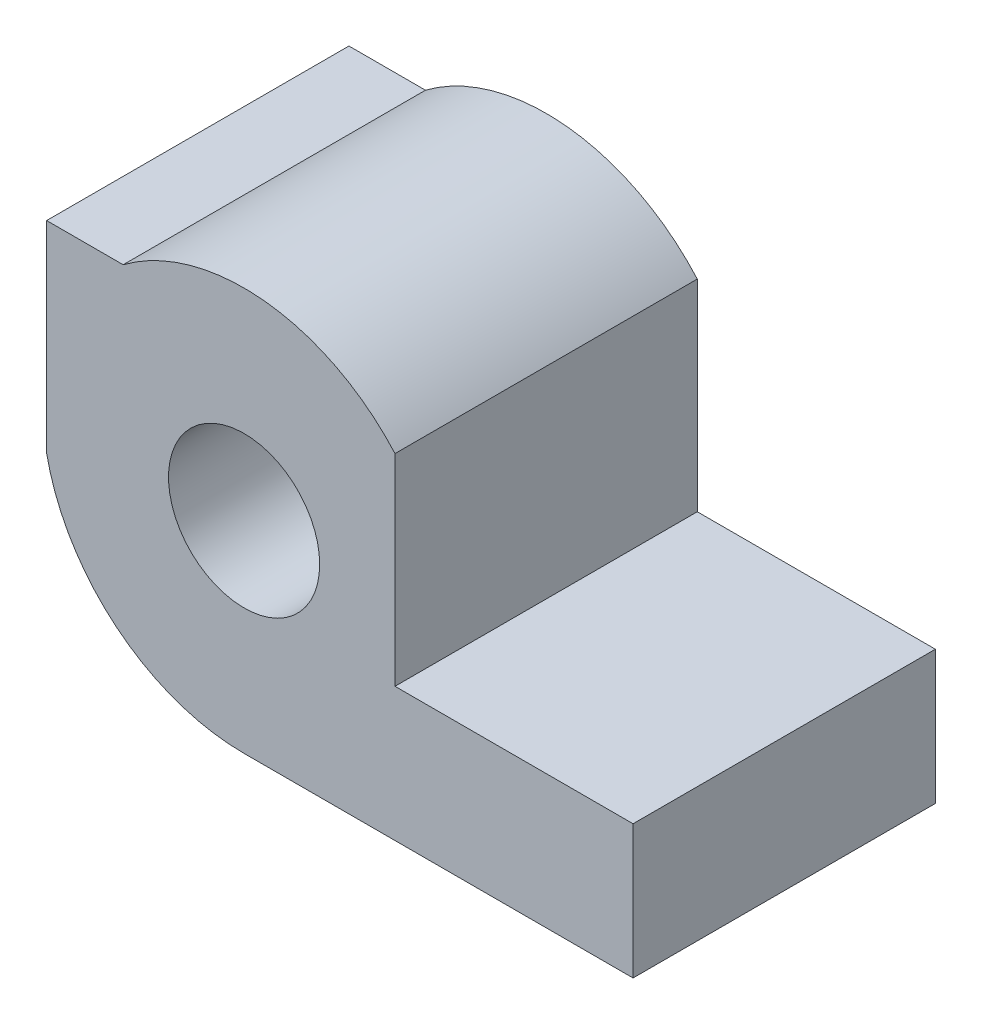
ISO-10303-21;
HEADER;
FILE_DESCRIPTION(('STEP AP214'),'2;1');
FILE_NAME('part.step','',(''),(''),'','','');
FILE_SCHEMA(('AUTOMOTIVE_DESIGN { 1 0 10303 214 1 1 1 1 }'));
ENDSEC;
DATA;
#1=APPLICATION_CONTEXT('core data for automotive mechanical design processes');
#2=APPLICATION_PROTOCOL_DEFINITION('international standard','automotive_design',2000,#1);
#3=PRODUCT_CONTEXT('',#1,'mechanical');
#4=PRODUCT('Part','Part','',(#3));
#5=PRODUCT_RELATED_PRODUCT_CATEGORY('part','',(#4));
#6=PRODUCT_DEFINITION_FORMATION('','',#4);
#7=PRODUCT_DEFINITION_CONTEXT('part definition',#1,'design');
#8=PRODUCT_DEFINITION('design','',#6,#7);
#9=PRODUCT_DEFINITION_SHAPE('','',#8);
#10=(LENGTH_UNIT() NAMED_UNIT(*) SI_UNIT(.MILLI.,.METRE.));
#11=(NAMED_UNIT(*) PLANE_ANGLE_UNIT() SI_UNIT($,.RADIAN.));
#12=(NAMED_UNIT(*) SI_UNIT($,.STERADIAN.) SOLID_ANGLE_UNIT());
#13=UNCERTAINTY_MEASURE_WITH_UNIT(LENGTH_MEASURE(1.E-05),#10,'distance_accuracy_value','');
#14=(GEOMETRIC_REPRESENTATION_CONTEXT(3) GLOBAL_UNCERTAINTY_ASSIGNED_CONTEXT((#13)) GLOBAL_UNIT_ASSIGNED_CONTEXT((#10,
#11,#12)) REPRESENTATION_CONTEXT('',''));
#15=CARTESIAN_POINT('',(0.,0.,0.));
#16=DIRECTION('',(0.,0.,1.));
#17=DIRECTION('',(1.,0.,0.));
#18=AXIS2_PLACEMENT_3D('',#15,#16,#17);
#19=CARTESIAN_POINT('',(0.599591794226535,0.,6.));
#20=DIRECTION('',(0.,0.,1.));
#21=DIRECTION('',(1.,0.,0.));
#22=AXIS2_PLACEMENT_3D('',#19,#20,#21);
#23=PLANE('',#22);
#24=CARTESIAN_POINT('',(0.599591794226535,0.,6.));
#25=DIRECTION('',(0.,0.,1.));
#26=DIRECTION('',(1.,0.,0.));
#27=AXIS2_PLACEMENT_3D('',#24,#25,#26);
#28=CIRCLE('',#27,3.99999999999998);
#29=CARTESIAN_POINT('',(-3.31959179422655,-0.799999999999803,6.));
#30=VERTEX_POINT('',#29);
#31=CARTESIAN_POINT('',(0.599591794226577,-4.,6.));
#32=VERTEX_POINT('',#31);
#33=EDGE_CURVE('E145',#30,#32,#28,.T.);
#34=ORIENTED_EDGE('',*,*,#33,.T.);
#35=DIRECTION('',(1.,0.,0.));
#36=VECTOR('',#35,1.);
#37=CARTESIAN_POINT('',(8.31959179422655,-4.,6.));
#38=LINE('',#37,#36);
#39=CARTESIAN_POINT('',(8.31959179422655,-4.,6.));
#40=VERTEX_POINT('',#39);
#41=EDGE_CURVE('E93',#32,#40,#38,.T.);
#42=ORIENTED_EDGE('',*,*,#41,.T.);
#43=DIRECTION('',(0.,1.,0.));
#44=VECTOR('',#43,1.);
#45=CARTESIAN_POINT('',(8.31959179422655,-1.34852681521835,6.));
#46=LINE('',#45,#44);
#47=CARTESIAN_POINT('',(8.31959179422655,-1.34852681521835,6.));
#48=VERTEX_POINT('',#47);
#49=EDGE_CURVE('E160',#40,#48,#46,.T.);
#50=ORIENTED_EDGE('',*,*,#49,.T.);
#51=DIRECTION('',(-1.,0.,0.));
#52=VECTOR('',#51,1.);
#53=CARTESIAN_POINT('',(3.59453585887705,-1.34852681521835,6.));
#54=LINE('',#53,#52);
#55=CARTESIAN_POINT('',(3.59453585887705,-1.34852681521835,6.));
#56=VERTEX_POINT('',#55);
#57=EDGE_CURVE('E173',#48,#56,#54,.T.);
#58=ORIENTED_EDGE('',*,*,#57,.T.);
#59=DIRECTION('',(0.,1.,0.));
#60=VECTOR('',#59,1.);
#61=CARTESIAN_POINT('',(3.59453585887705,2.65147318478138,6.));
#62=LINE('',#61,#60);
#63=CARTESIAN_POINT('',(3.59453585887705,2.65147318478138,6.));
#64=VERTEX_POINT('',#63);
#65=EDGE_CURVE('E112',#56,#64,#62,.T.);
#66=ORIENTED_EDGE('',*,*,#65,.T.);
#67=CARTESIAN_POINT('',(0.599591794226535,0.,6.));
#68=DIRECTION('',(0.,0.,1.));
#69=DIRECTION('',(1.,0.,0.));
#70=AXIS2_PLACEMENT_3D('',#67,#68,#69);
#71=CIRCLE('',#70,4.);
#72=CARTESIAN_POINT('',(-1.80040820577347,3.2,6.));
#73=VERTEX_POINT('',#72);
#74=EDGE_CURVE('E106',#64,#73,#71,.T.);
#75=ORIENTED_EDGE('',*,*,#74,.T.);
#76=DIRECTION('',(-1.,0.,0.));
#77=VECTOR('',#76,1.);
#78=CARTESIAN_POINT('',(-3.31959179422655,3.2,6.));
#79=LINE('',#78,#77);
#80=CARTESIAN_POINT('',(-3.31959179422655,3.2,6.));
#81=VERTEX_POINT('',#80);
#82=EDGE_CURVE('E110',#73,#81,#79,.T.);
#83=ORIENTED_EDGE('',*,*,#82,.T.);
#84=DIRECTION('',(0.,-1.,0.));
#85=VECTOR('',#84,1.);
#86=CARTESIAN_POINT('',(-3.31959179422655,3.2,6.));
#87=LINE('',#86,#85);
#88=EDGE_CURVE('E50',#81,#30,#87,.T.);
#89=ORIENTED_EDGE('',*,*,#88,.T.);
#90=EDGE_LOOP('',(#34,#42,#50,#58,#66,#75,#83,#89));
#91=FACE_BOUND('',#90,.T.);
#92=CARTESIAN_POINT('',(0.599591794226535,0.,6.));
#93=DIRECTION('',(0.,0.,1.));
#94=DIRECTION('',(1.,0.,0.));
#95=AXIS2_PLACEMENT_3D('',#92,#93,#94);
#96=CIRCLE('',#95,1.5);
#97=CARTESIAN_POINT('',(2.09959179422654,0.,6.));
#98=VERTEX_POINT('',#97);
#99=EDGE_CURVE('E134',#98,#98,#96,.T.);
#100=ORIENTED_EDGE('',*,*,#99,.F.);
#101=EDGE_LOOP('',(#100));
#102=FACE_BOUND('',#101,.T.);
#103=ADVANCED_FACE('F33',(#91,#102),#23,.T.);
#104=CARTESIAN_POINT('',(0.599591794226535,0.,0.));
#105=DIRECTION('',(0.,0.,1.));
#106=DIRECTION('',(1.,0.,0.));
#107=AXIS2_PLACEMENT_3D('',#104,#105,#106);
#108=PLANE('',#107);
#109=CARTESIAN_POINT('',(0.599591794226535,0.,0.));
#110=DIRECTION('',(0.,0.,1.));
#111=DIRECTION('',(1.,0.,0.));
#112=AXIS2_PLACEMENT_3D('',#109,#110,#111);
#113=CIRCLE('',#112,3.99999999999998);
#114=CARTESIAN_POINT('',(-3.31959179422655,-0.799999999999803,0.));
#115=VERTEX_POINT('',#114);
#116=CARTESIAN_POINT('',(0.599591794226577,-4.,0.));
#117=VERTEX_POINT('',#116);
#118=EDGE_CURVE('E130',#115,#117,#113,.T.);
#119=ORIENTED_EDGE('',*,*,#118,.F.);
#120=DIRECTION('',(0.,-1.,0.));
#121=VECTOR('',#120,1.);
#122=CARTESIAN_POINT('',(-3.31959179422655,3.2,0.));
#123=LINE('',#122,#121);
#124=CARTESIAN_POINT('',(-3.31959179422655,3.2,0.));
#125=VERTEX_POINT('',#124);
#126=EDGE_CURVE('E85',#125,#115,#123,.T.);
#127=ORIENTED_EDGE('',*,*,#126,.F.);
#128=DIRECTION('',(-1.,0.,0.));
#129=VECTOR('',#128,1.);
#130=CARTESIAN_POINT('',(-3.31959179422655,3.2,0.));
#131=LINE('',#130,#129);
#132=CARTESIAN_POINT('',(-1.80040820577347,3.2,0.));
#133=VERTEX_POINT('',#132);
#134=EDGE_CURVE('E79',#133,#125,#131,.T.);
#135=ORIENTED_EDGE('',*,*,#134,.F.);
#136=CARTESIAN_POINT('',(0.599591794226535,0.,0.));
#137=DIRECTION('',(0.,0.,1.));
#138=DIRECTION('',(1.,0.,0.));
#139=AXIS2_PLACEMENT_3D('',#136,#137,#138);
#140=CIRCLE('',#139,4.);
#141=CARTESIAN_POINT('',(3.59453585887705,2.65147318478138,0.));
#142=VERTEX_POINT('',#141);
#143=EDGE_CURVE('E120',#142,#133,#140,.T.);
#144=ORIENTED_EDGE('',*,*,#143,.F.);
#145=DIRECTION('',(0.,1.,0.));
#146=VECTOR('',#145,1.);
#147=CARTESIAN_POINT('',(3.59453585887705,2.65147318478138,0.));
#148=LINE('',#147,#146);
#149=CARTESIAN_POINT('',(3.59453585887705,-1.34852681521835,0.));
#150=VERTEX_POINT('',#149);
#151=EDGE_CURVE('E140',#150,#142,#148,.T.);
#152=ORIENTED_EDGE('',*,*,#151,.F.);
#153=DIRECTION('',(-1.,0.,0.));
#154=VECTOR('',#153,1.);
#155=CARTESIAN_POINT('',(3.59453585887705,-1.34852681521835,0.));
#156=LINE('',#155,#154);
#157=CARTESIAN_POINT('',(8.31959179422655,-1.34852681521835,0.));
#158=VERTEX_POINT('',#157);
#159=EDGE_CURVE('E138',#158,#150,#156,.T.);
#160=ORIENTED_EDGE('',*,*,#159,.F.);
#161=DIRECTION('',(0.,1.,0.));
#162=VECTOR('',#161,1.);
#163=CARTESIAN_POINT('',(8.31959179422655,-1.34852681521835,0.));
#164=LINE('',#163,#162);
#165=CARTESIAN_POINT('',(8.31959179422655,-4.,0.));
#166=VERTEX_POINT('',#165);
#167=EDGE_CURVE('E136',#166,#158,#164,.T.);
#168=ORIENTED_EDGE('',*,*,#167,.F.);
#169=DIRECTION('',(1.,0.,0.));
#170=VECTOR('',#169,1.);
#171=CARTESIAN_POINT('',(8.31959179422655,-4.,0.));
#172=LINE('',#171,#170);
#173=EDGE_CURVE('E133',#117,#166,#172,.T.);
#174=ORIENTED_EDGE('',*,*,#173,.F.);
#175=EDGE_LOOP('',(#119,#127,#135,#144,#152,#160,#168,#174));
#176=FACE_BOUND('',#175,.T.);
#177=CARTESIAN_POINT('',(0.599591794226535,0.,0.));
#178=DIRECTION('',(0.,0.,1.));
#179=DIRECTION('',(1.,0.,0.));
#180=AXIS2_PLACEMENT_3D('',#177,#178,#179);
#181=CIRCLE('',#180,1.5);
#182=CARTESIAN_POINT('',(2.09959179422654,0.,0.));
#183=VERTEX_POINT('',#182);
#184=EDGE_CURVE('E179',#183,#183,#181,.T.);
#185=ORIENTED_EDGE('',*,*,#184,.T.);
#186=EDGE_LOOP('',(#185));
#187=FACE_BOUND('',#186,.T.);
#188=ADVANCED_FACE('F164',(#176,#187),#108,.F.);
#189=CARTESIAN_POINT('',(0.599591794226535,0.,6.));
#190=DIRECTION('',(0.,0.,-1.));
#191=DIRECTION('',(-1.,0.,0.));
#192=AXIS2_PLACEMENT_3D('',#189,#190,#191);
#193=CYLINDRICAL_SURFACE('',#192,3.99999999999998);
#194=ORIENTED_EDGE('',*,*,#118,.T.);
#195=DIRECTION('',(0.,0.,-1.));
#196=VECTOR('',#195,1.);
#197=CARTESIAN_POINT('',(0.599591794226577,-4.,6.));
#198=LINE('',#197,#196);
#199=EDGE_CURVE('E11',#32,#117,#198,.T.);
#200=ORIENTED_EDGE('',*,*,#199,.F.);
#201=ORIENTED_EDGE('',*,*,#33,.F.);
#202=DIRECTION('',(0.,0.,-1.));
#203=VECTOR('',#202,1.);
#204=CARTESIAN_POINT('',(-3.31959179422655,-0.799999999999803,6.));
#205=LINE('',#204,#203);
#206=EDGE_CURVE('E126',#30,#115,#205,.T.);
#207=ORIENTED_EDGE('',*,*,#206,.T.);
#208=EDGE_LOOP('',(#194,#200,#201,#207));
#209=FACE_BOUND('',#208,.T.);
#210=ADVANCED_FACE('F35',(#209),#193,.T.);
#211=CARTESIAN_POINT('',(8.31959179422655,-4.,6.));
#212=DIRECTION('',(0.,1.,0.));
#213=DIRECTION('',(0.,0.,1.));
#214=AXIS2_PLACEMENT_3D('',#211,#212,#213);
#215=PLANE('',#214);
#216=ORIENTED_EDGE('',*,*,#173,.T.);
#217=DIRECTION('',(0.,0.,-1.));
#218=VECTOR('',#217,1.);
#219=CARTESIAN_POINT('',(8.31959179422655,-4.,6.));
#220=LINE('',#219,#218);
#221=EDGE_CURVE('E42',#40,#166,#220,.T.);
#222=ORIENTED_EDGE('',*,*,#221,.F.);
#223=ORIENTED_EDGE('',*,*,#41,.F.);
#224=ORIENTED_EDGE('',*,*,#199,.T.);
#225=EDGE_LOOP('',(#216,#222,#223,#224));
#226=FACE_BOUND('',#225,.T.);
#227=ADVANCED_FACE('F207',(#226),#215,.F.);
#228=CARTESIAN_POINT('',(8.31959179422655,-1.34852681521835,6.));
#229=DIRECTION('',(-1.,0.,0.));
#230=DIRECTION('',(0.,0.,1.));
#231=AXIS2_PLACEMENT_3D('',#228,#229,#230);
#232=PLANE('',#231);
#233=ORIENTED_EDGE('',*,*,#167,.T.);
#234=DIRECTION('',(0.,0.,-1.));
#235=VECTOR('',#234,1.);
#236=CARTESIAN_POINT('',(8.31959179422655,-1.34852681521835,6.));
#237=LINE('',#236,#235);
#238=EDGE_CURVE('E152',#48,#158,#237,.T.);
#239=ORIENTED_EDGE('',*,*,#238,.F.);
#240=ORIENTED_EDGE('',*,*,#49,.F.);
#241=ORIENTED_EDGE('',*,*,#221,.T.);
#242=EDGE_LOOP('',(#233,#239,#240,#241));
#243=FACE_BOUND('',#242,.T.);
#244=ADVANCED_FACE('F158',(#243),#232,.F.);
#245=CARTESIAN_POINT('',(3.59453585887705,-1.34852681521835,6.));
#246=DIRECTION('',(0.,-1.,0.));
#247=DIRECTION('',(0.,0.,-1.));
#248=AXIS2_PLACEMENT_3D('',#245,#246,#247);
#249=PLANE('',#248);
#250=ORIENTED_EDGE('',*,*,#159,.T.);
#251=DIRECTION('',(0.,0.,-1.));
#252=VECTOR('',#251,1.);
#253=CARTESIAN_POINT('',(3.59453585887705,-1.34852681521835,6.));
#254=LINE('',#253,#252);
#255=EDGE_CURVE('E149',#56,#150,#254,.T.);
#256=ORIENTED_EDGE('',*,*,#255,.F.);
#257=ORIENTED_EDGE('',*,*,#57,.F.);
#258=ORIENTED_EDGE('',*,*,#238,.T.);
#259=EDGE_LOOP('',(#250,#256,#257,#258));
#260=FACE_BOUND('',#259,.T.);
#261=ADVANCED_FACE('F169',(#260),#249,.F.);
#262=CARTESIAN_POINT('',(3.59453585887705,2.65147318478138,6.));
#263=DIRECTION('',(-1.,0.,0.));
#264=DIRECTION('',(0.,-1.,0.));
#265=AXIS2_PLACEMENT_3D('',#262,#263,#264);
#266=PLANE('',#265);
#267=ORIENTED_EDGE('',*,*,#151,.T.);
#268=DIRECTION('',(0.,0.,-1.));
#269=VECTOR('',#268,1.);
#270=CARTESIAN_POINT('',(3.59453585887705,2.65147318478138,6.));
#271=LINE('',#270,#269);
#272=EDGE_CURVE('E121',#64,#142,#271,.T.);
#273=ORIENTED_EDGE('',*,*,#272,.F.);
#274=ORIENTED_EDGE('',*,*,#65,.F.);
#275=ORIENTED_EDGE('',*,*,#255,.T.);
#276=EDGE_LOOP('',(#267,#273,#274,#275));
#277=FACE_BOUND('',#276,.T.);
#278=ADVANCED_FACE('F172',(#277),#266,.F.);
#279=CARTESIAN_POINT('',(0.599591794226535,0.,6.));
#280=DIRECTION('',(0.,0.,-1.));
#281=DIRECTION('',(-1.,0.,0.));
#282=AXIS2_PLACEMENT_3D('',#279,#280,#281);
#283=CYLINDRICAL_SURFACE('',#282,4.);
#284=ORIENTED_EDGE('',*,*,#143,.T.);
#285=DIRECTION('',(0.,0.,-1.));
#286=VECTOR('',#285,1.);
#287=CARTESIAN_POINT('',(-1.80040820577347,3.2,6.));
#288=LINE('',#287,#286);
#289=EDGE_CURVE('E117',#73,#133,#288,.T.);
#290=ORIENTED_EDGE('',*,*,#289,.F.);
#291=ORIENTED_EDGE('',*,*,#74,.F.);
#292=ORIENTED_EDGE('',*,*,#272,.T.);
#293=EDGE_LOOP('',(#284,#290,#291,#292));
#294=FACE_BOUND('',#293,.T.);
#295=ADVANCED_FACE('F118',(#294),#283,.T.);
#296=CARTESIAN_POINT('',(-3.31959179422655,3.2,6.));
#297=DIRECTION('',(0.,-1.,0.));
#298=DIRECTION('',(0.,0.,-1.));
#299=AXIS2_PLACEMENT_3D('',#296,#297,#298);
#300=PLANE('',#299);
#301=ORIENTED_EDGE('',*,*,#134,.T.);
#302=DIRECTION('',(0.,0.,-1.));
#303=VECTOR('',#302,1.);
#304=CARTESIAN_POINT('',(-3.31959179422655,3.2,6.));
#305=LINE('',#304,#303);
#306=EDGE_CURVE('E122',#81,#125,#305,.T.);
#307=ORIENTED_EDGE('',*,*,#306,.F.);
#308=ORIENTED_EDGE('',*,*,#82,.F.);
#309=ORIENTED_EDGE('',*,*,#289,.T.);
#310=EDGE_LOOP('',(#301,#307,#308,#309));
#311=FACE_BOUND('',#310,.T.);
#312=ADVANCED_FACE('F124',(#311),#300,.F.);
#313=CARTESIAN_POINT('',(-3.31959179422655,3.2,6.));
#314=DIRECTION('',(1.,0.,0.));
#315=DIRECTION('',(0.,0.,-1.));
#316=AXIS2_PLACEMENT_3D('',#313,#314,#315);
#317=PLANE('',#316);
#318=ORIENTED_EDGE('',*,*,#126,.T.);
#319=ORIENTED_EDGE('',*,*,#206,.F.);
#320=ORIENTED_EDGE('',*,*,#88,.F.);
#321=ORIENTED_EDGE('',*,*,#306,.T.);
#322=EDGE_LOOP('',(#318,#319,#320,#321));
#323=FACE_BOUND('',#322,.T.);
#324=ADVANCED_FACE('F195',(#323),#317,.F.);
#325=CARTESIAN_POINT('',(0.599591794226535,0.,6.));
#326=DIRECTION('',(0.,0.,-1.));
#327=DIRECTION('',(-1.,0.,0.));
#328=AXIS2_PLACEMENT_3D('',#325,#326,#327);
#329=CYLINDRICAL_SURFACE('',#328,1.5);
#330=ORIENTED_EDGE('',*,*,#99,.T.);
#331=EDGE_LOOP('',(#330));
#332=FACE_BOUND('',#331,.T.);
#333=ORIENTED_EDGE('',*,*,#184,.F.);
#334=EDGE_LOOP('',(#333));
#335=FACE_BOUND('',#334,.T.);
#336=ADVANCED_FACE('F185',(#332,#335),#329,.F.);
#337=CLOSED_SHELL('',(#103,#188,#210,#227,#244,#261,#278,#295,#312,#324,#336));
#338=MANIFOLD_SOLID_BREP('B2',#337);
#339=ADVANCED_BREP_SHAPE_REPRESENTATION('',(#18,#338),#14);
#340=SHAPE_DEFINITION_REPRESENTATION(#9,#339);
ENDSEC;
END-ISO-10303-21;
